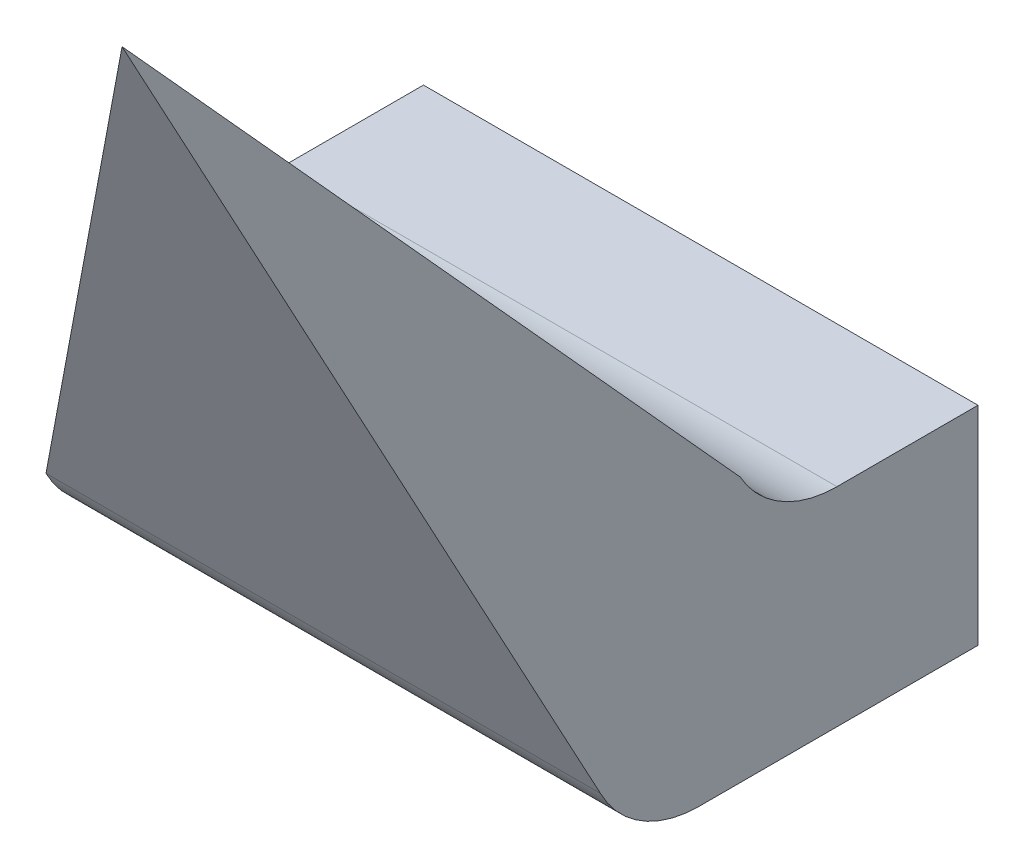
ISO-10303-21;
HEADER;
FILE_DESCRIPTION(('STEP AP214'),'2;1');
FILE_NAME('part.step','',(''),(''),'','','');
FILE_SCHEMA(('AUTOMOTIVE_DESIGN { 1 0 10303 214 1 1 1 1 }'));
ENDSEC;
DATA;
#1=APPLICATION_CONTEXT('core data for automotive mechanical design processes');
#2=APPLICATION_PROTOCOL_DEFINITION('international standard','automotive_design',2000,#1);
#3=PRODUCT_CONTEXT('',#1,'mechanical');
#4=PRODUCT('Part','Part','',(#3));
#5=PRODUCT_RELATED_PRODUCT_CATEGORY('part','',(#4));
#6=PRODUCT_DEFINITION_FORMATION('','',#4);
#7=PRODUCT_DEFINITION_CONTEXT('part definition',#1,'design');
#8=PRODUCT_DEFINITION('design','',#6,#7);
#9=PRODUCT_DEFINITION_SHAPE('','',#8);
#10=(LENGTH_UNIT() NAMED_UNIT(*) SI_UNIT(.MILLI.,.METRE.));
#11=(NAMED_UNIT(*) PLANE_ANGLE_UNIT() SI_UNIT($,.RADIAN.));
#12=(NAMED_UNIT(*) SI_UNIT($,.STERADIAN.) SOLID_ANGLE_UNIT());
#13=UNCERTAINTY_MEASURE_WITH_UNIT(LENGTH_MEASURE(1.E-05),#10,'distance_accuracy_value','');
#14=(GEOMETRIC_REPRESENTATION_CONTEXT(3) GLOBAL_UNCERTAINTY_ASSIGNED_CONTEXT((#13)) GLOBAL_UNIT_ASSIGNED_CONTEXT((#10,
#11,#12)) REPRESENTATION_CONTEXT('',''));
#15=CARTESIAN_POINT('',(0.,0.,0.));
#16=DIRECTION('',(0.,0.,1.));
#17=DIRECTION('',(1.,0.,0.));
#18=AXIS2_PLACEMENT_3D('',#15,#16,#17);
#19=CARTESIAN_POINT('',(-71.13907229268,21.89380350451,21.814122866963));
#20=DIRECTION('',(0.,0.455111059789055,-0.890434682196108));
#21=DIRECTION('',(0.,0.890434682196108,0.455111059789055));
#22=AXIS2_PLACEMENT_3D('',#19,#20,#21);
#23=PLANE('',#22);
#24=DIRECTION('',(-1.,0.,0.));
#25=VECTOR('',#24,1.);
#26=CARTESIAN_POINT('',(-71.13907229268,21.8938035045101,21.8141228669628));
#27=LINE('',#26,#25);
#28=CARTESIAN_POINT('',(-71.13907229268,21.8938035045099,21.8141228669628));
#29=VERTEX_POINT('',#28);
#30=CARTESIAN_POINT('',(-71.53907229268,21.8938035045099,21.8141228669628));
#31=VERTEX_POINT('',#30);
#32=EDGE_CURVE('E83',#29,#31,#27,.T.);
#33=ORIENTED_EDGE('',*,*,#32,.F.);
#34=DIRECTION('',(0.,-0.890434682195817,-0.455111059789624));
#35=VECTOR('',#34,1.);
#36=CARTESIAN_POINT('',(-71.13907229268,22.256621274076,21.999563060297));
#37=LINE('',#36,#35);
#38=CARTESIAN_POINT('',(-71.33907229268,22.3329201022555,21.959256338043));
#39=VERTEX_POINT('',#38);
#40=EDGE_CURVE('E47',#39,#29,#37,.T.);
#41=ORIENTED_EDGE('',*,*,#40,.F.);
#42=DIRECTION('',(0.,-0.890434682195817,-0.455111059789624));
#43=VECTOR('',#42,1.);
#44=CARTESIAN_POINT('',(-71.53907229268,22.256621274076,21.999563060297));
#45=LINE('',#44,#43);
#46=EDGE_CURVE('E97',#39,#31,#45,.T.);
#47=ORIENTED_EDGE('',*,*,#46,.T.);
#48=EDGE_LOOP('',(#33,#41,#47));
#49=FACE_BOUND('',#48,.T.);
#50=ADVANCED_FACE('F17',(#49),#23,.F.);
#51=CARTESIAN_POINT('',(-71.13907229268,21.930212389293,21.742888092387));
#52=DIRECTION('',(-1.,0.,0.));
#53=DIRECTION('',(0.,0.,1.));
#54=AXIS2_PLACEMENT_3D('',#51,#52,#53);
#55=CYLINDRICAL_SURFACE('',#54,0.08);
#56=CARTESIAN_POINT('',(-71.13907229268,21.930212389293,21.742888092387));
#57=DIRECTION('',(-1.,0.,0.));
#58=DIRECTION('',(0.,0.,1.));
#59=AXIS2_PLACEMENT_3D('',#56,#57,#58);
#60=CIRCLE('',#59,0.08);
#61=CARTESIAN_POINT('',(-71.13907229268,21.850212389293,21.742888092387));
#62=VERTEX_POINT('',#61);
#63=EDGE_CURVE('E20',#29,#62,#60,.F.);
#64=ORIENTED_EDGE('',*,*,#63,.F.);
#65=ORIENTED_EDGE('',*,*,#32,.T.);
#66=CARTESIAN_POINT('',(-71.53907229268,21.930212389293,21.742888092387));
#67=DIRECTION('',(-1.,0.,0.));
#68=DIRECTION('',(0.,0.,1.));
#69=AXIS2_PLACEMENT_3D('',#66,#67,#68);
#70=CIRCLE('',#69,0.08);
#71=CARTESIAN_POINT('',(-71.53907229268,21.850212389293,21.742888092387));
#72=VERTEX_POINT('',#71);
#73=EDGE_CURVE('E90',#31,#72,#70,.F.);
#74=ORIENTED_EDGE('',*,*,#73,.T.);
#75=DIRECTION('',(1.,0.,0.));
#76=VECTOR('',#75,1.);
#77=CARTESIAN_POINT('',(-71.13907229268,21.850212389293,21.742888092387));
#78=LINE('',#77,#76);
#79=EDGE_CURVE('E76',#72,#62,#78,.T.);
#80=ORIENTED_EDGE('',*,*,#79,.T.);
#81=EDGE_LOOP('',(#64,#65,#74,#80));
#82=FACE_BOUND('',#81,.T.);
#83=ADVANCED_FACE('F96',(#82),#55,.T.);
#84=CARTESIAN_POINT('',(-71.13907229268,21.850212389293,21.54184296363));
#85=DIRECTION('',(0.,1.,0.));
#86=DIRECTION('',(0.,0.,1.));
#87=AXIS2_PLACEMENT_3D('',#84,#85,#86);
#88=PLANE('',#87);
#89=DIRECTION('',(1.,0.,0.));
#90=VECTOR('',#89,1.);
#91=CARTESIAN_POINT('',(-71.13907229268,21.850212389293,21.54184296363));
#92=LINE('',#91,#90);
#93=CARTESIAN_POINT('',(-71.53907229268,21.850212389293,21.54184296363));
#94=VERTEX_POINT('',#93);
#95=CARTESIAN_POINT('',(-71.13907229268,21.850212389293,21.54184296363));
#96=VERTEX_POINT('',#95);
#97=EDGE_CURVE('E82',#94,#96,#92,.T.);
#98=ORIENTED_EDGE('',*,*,#97,.T.);
#99=DIRECTION('',(0.,0.,-1.));
#100=VECTOR('',#99,1.);
#101=CARTESIAN_POINT('',(-71.13907229268,21.850212389293,21.988795802143));
#102=LINE('',#101,#100);
#103=EDGE_CURVE('E57',#62,#96,#102,.T.);
#104=ORIENTED_EDGE('',*,*,#103,.F.);
#105=ORIENTED_EDGE('',*,*,#79,.F.);
#106=DIRECTION('',(0.,0.,-1.));
#107=VECTOR('',#106,1.);
#108=CARTESIAN_POINT('',(-71.53907229268,21.850212389293,21.988795802143));
#109=LINE('',#108,#107);
#110=EDGE_CURVE('E79',#72,#94,#109,.T.);
#111=ORIENTED_EDGE('',*,*,#110,.T.);
#112=EDGE_LOOP('',(#98,#104,#105,#111));
#113=FACE_BOUND('',#112,.T.);
#114=ADVANCED_FACE('F78',(#113),#88,.F.);
#115=CARTESIAN_POINT('',(-71.13907229268,22.000212389293,21.54184296363));
#116=DIRECTION('',(0.,0.,1.));
#117=DIRECTION('',(1.,0.,0.));
#118=AXIS2_PLACEMENT_3D('',#115,#116,#117);
#119=PLANE('',#118);
#120=DIRECTION('',(1.,0.,0.));
#121=VECTOR('',#120,1.);
#122=CARTESIAN_POINT('',(-71.13907229268,22.000212389293,21.54184296363));
#123=LINE('',#122,#121);
#124=CARTESIAN_POINT('',(-71.53907229268,22.000212389293,21.54184296363));
#125=VERTEX_POINT('',#124);
#126=CARTESIAN_POINT('',(-71.13907229268,22.000212389293,21.54184296363));
#127=VERTEX_POINT('',#126);
#128=EDGE_CURVE('E123',#125,#127,#123,.T.);
#129=ORIENTED_EDGE('',*,*,#128,.T.);
#130=DIRECTION('',(0.,1.,0.));
#131=VECTOR('',#130,1.);
#132=CARTESIAN_POINT('',(-71.13907229268,22.370212389293,21.54184296363));
#133=LINE('',#132,#131);
#134=EDGE_CURVE('E104',#96,#127,#133,.T.);
#135=ORIENTED_EDGE('',*,*,#134,.F.);
#136=ORIENTED_EDGE('',*,*,#97,.F.);
#137=DIRECTION('',(0.,1.,0.));
#138=VECTOR('',#137,1.);
#139=CARTESIAN_POINT('',(-71.53907229268,22.370212389293,21.54184296363));
#140=LINE('',#139,#138);
#141=EDGE_CURVE('E94',#94,#125,#140,.T.);
#142=ORIENTED_EDGE('',*,*,#141,.T.);
#143=EDGE_LOOP('',(#129,#135,#136,#142));
#144=FACE_BOUND('',#143,.T.);
#145=ADVANCED_FACE('F138',(#144),#119,.F.);
#146=CARTESIAN_POINT('',(-71.13907229268,22.000212389293,21.643581579434));
#147=DIRECTION('',(0.,-1.,0.));
#148=DIRECTION('',(0.,0.,-1.));
#149=AXIS2_PLACEMENT_3D('',#146,#147,#148);
#150=PLANE('',#149);
#151=DIRECTION('',(-1.,0.,0.));
#152=VECTOR('',#151,1.);
#153=CARTESIAN_POINT('',(-71.13907229268,22.000212389293,21.643581579434));
#154=LINE('',#153,#152);
#155=CARTESIAN_POINT('',(-71.53907229268,22.000212389293,21.643581579434));
#156=VERTEX_POINT('',#155);
#157=CARTESIAN_POINT('',(-71.13907229268,22.000212389293,21.643581579434));
#158=VERTEX_POINT('',#157);
#159=EDGE_CURVE('E119',#156,#158,#154,.F.);
#160=ORIENTED_EDGE('',*,*,#159,.T.);
#161=DIRECTION('',(0.,0.,-1.));
#162=VECTOR('',#161,1.);
#163=CARTESIAN_POINT('',(-71.13907229268,22.000212389293,21.988795802143));
#164=LINE('',#163,#162);
#165=EDGE_CURVE('E103',#127,#158,#164,.F.);
#166=ORIENTED_EDGE('',*,*,#165,.F.);
#167=ORIENTED_EDGE('',*,*,#128,.F.);
#168=DIRECTION('',(0.,0.,-1.));
#169=VECTOR('',#168,1.);
#170=CARTESIAN_POINT('',(-71.53907229268,22.000212389293,21.988795802143));
#171=LINE('',#170,#169);
#172=EDGE_CURVE('E129',#125,#156,#171,.F.);
#173=ORIENTED_EDGE('',*,*,#172,.T.);
#174=EDGE_LOOP('',(#160,#166,#167,#173));
#175=FACE_BOUND('',#174,.T.);
#176=ADVANCED_FACE('F151',(#175),#150,.F.);
#177=CARTESIAN_POINT('',(-71.13907229268,22.080212389293,21.643581579434));
#178=DIRECTION('',(-1.,0.,0.));
#179=DIRECTION('',(0.,0.,1.));
#180=AXIS2_PLACEMENT_3D('',#177,#178,#179);
#181=CYLINDRICAL_SURFACE('',#180,0.08);
#182=DIRECTION('',(1.,0.,0.));
#183=VECTOR('',#182,1.);
#184=CARTESIAN_POINT('',(-71.13907229268,22.0412058481508,21.7134277657873));
#185=LINE('',#184,#183);
#186=CARTESIAN_POINT('',(-71.53907229268,22.0412058481509,21.7134277657873));
#187=VERTEX_POINT('',#186);
#188=CARTESIAN_POINT('',(-71.13907229268,22.0412058481509,21.7134277657873));
#189=VERTEX_POINT('',#188);
#190=EDGE_CURVE('E161',#187,#189,#185,.T.);
#191=ORIENTED_EDGE('',*,*,#190,.T.);
#192=CARTESIAN_POINT('',(-71.13907229268,22.080212389293,21.643581579434));
#193=DIRECTION('',(-1.,0.,0.));
#194=DIRECTION('',(0.,0.,1.));
#195=AXIS2_PLACEMENT_3D('',#192,#193,#194);
#196=CIRCLE('',#195,0.08);
#197=EDGE_CURVE('E35',#158,#189,#196,.T.);
#198=ORIENTED_EDGE('',*,*,#197,.F.);
#199=ORIENTED_EDGE('',*,*,#159,.F.);
#200=CARTESIAN_POINT('',(-71.53907229268,22.080212389293,21.643581579434));
#201=DIRECTION('',(-1.,0.,0.));
#202=DIRECTION('',(0.,0.,1.));
#203=AXIS2_PLACEMENT_3D('',#200,#201,#202);
#204=CIRCLE('',#203,0.08);
#205=EDGE_CURVE('E101',#156,#187,#204,.T.);
#206=ORIENTED_EDGE('',*,*,#205,.T.);
#207=EDGE_LOOP('',(#191,#198,#199,#206));
#208=FACE_BOUND('',#207,.T.);
#209=ADVANCED_FACE('F142',(#208),#181,.F.);
#210=CARTESIAN_POINT('',(-71.13907229268,22.370212389293,21.988795802143));
#211=DIRECTION('',(1.,0.,0.));
#212=DIRECTION('',(0.,0.,-1.));
#213=AXIS2_PLACEMENT_3D('',#210,#211,#212);
#214=PLANE('',#213);
#215=DIRECTION('',(0.,-0.873077329419039,-0.487581764276022));
#216=VECTOR('',#215,1.);
#217=CARTESIAN_POINT('',(-71.13907229268,22.409218930435,21.918949615789));
#218=LINE('',#217,#216);
#219=EDGE_CURVE('E26',#189,#39,#218,.F.);
#220=ORIENTED_EDGE('',*,*,#219,.T.);
#221=ORIENTED_EDGE('',*,*,#40,.T.);
#222=ORIENTED_EDGE('',*,*,#63,.T.);
#223=ORIENTED_EDGE('',*,*,#103,.T.);
#224=ORIENTED_EDGE('',*,*,#134,.T.);
#225=ORIENTED_EDGE('',*,*,#165,.T.);
#226=ORIENTED_EDGE('',*,*,#197,.T.);
#227=EDGE_LOOP('',(#220,#221,#222,#223,#224,#225,#226));
#228=FACE_BOUND('',#227,.T.);
#229=ADVANCED_FACE('F140',(#228),#214,.T.);
#230=CARTESIAN_POINT('',(-71.53907229268,22.370212389293,21.988795802143));
#231=DIRECTION('',(1.,0.,0.));
#232=DIRECTION('',(0.,0.,-1.));
#233=AXIS2_PLACEMENT_3D('',#230,#231,#232);
#234=PLANE('',#233);
#235=DIRECTION('',(0.,-0.873077329419039,-0.487581764276022));
#236=VECTOR('',#235,1.);
#237=CARTESIAN_POINT('',(-71.53907229268,22.409218930435,21.918949615789));
#238=LINE('',#237,#236);
#239=EDGE_CURVE('E11',#39,#187,#238,.T.);
#240=ORIENTED_EDGE('',*,*,#239,.T.);
#241=ORIENTED_EDGE('',*,*,#205,.F.);
#242=ORIENTED_EDGE('',*,*,#172,.F.);
#243=ORIENTED_EDGE('',*,*,#141,.F.);
#244=ORIENTED_EDGE('',*,*,#110,.F.);
#245=ORIENTED_EDGE('',*,*,#73,.F.);
#246=ORIENTED_EDGE('',*,*,#46,.F.);
#247=EDGE_LOOP('',(#240,#241,#242,#243,#244,#245,#246));
#248=FACE_BOUND('',#247,.T.);
#249=ADVANCED_FACE('F88',(#248),#234,.F.);
#250=CARTESIAN_POINT('',(-71.13907229268,22.409218930435,21.918949615789));
#251=DIRECTION('',(0.,-0.487581764276022,0.873077329419039));
#252=DIRECTION('',(0.,-0.873077329419039,-0.487581764276022));
#253=AXIS2_PLACEMENT_3D('',#250,#251,#252);
#254=PLANE('',#253);
#255=ORIENTED_EDGE('',*,*,#219,.F.);
#256=ORIENTED_EDGE('',*,*,#190,.F.);
#257=ORIENTED_EDGE('',*,*,#239,.F.);
#258=EDGE_LOOP('',(#255,#256,#257));
#259=FACE_BOUND('',#258,.T.);
#260=ADVANCED_FACE('F149',(#259),#254,.F.);
#261=CLOSED_SHELL('',(#50,#83,#114,#145,#176,#209,#229,#249,#260));
#262=MANIFOLD_SOLID_BREP('B1',#261);
#263=ADVANCED_BREP_SHAPE_REPRESENTATION('',(#18,#262),#14);
#264=SHAPE_DEFINITION_REPRESENTATION(#9,#263);
ENDSEC;
END-ISO-10303-21;
